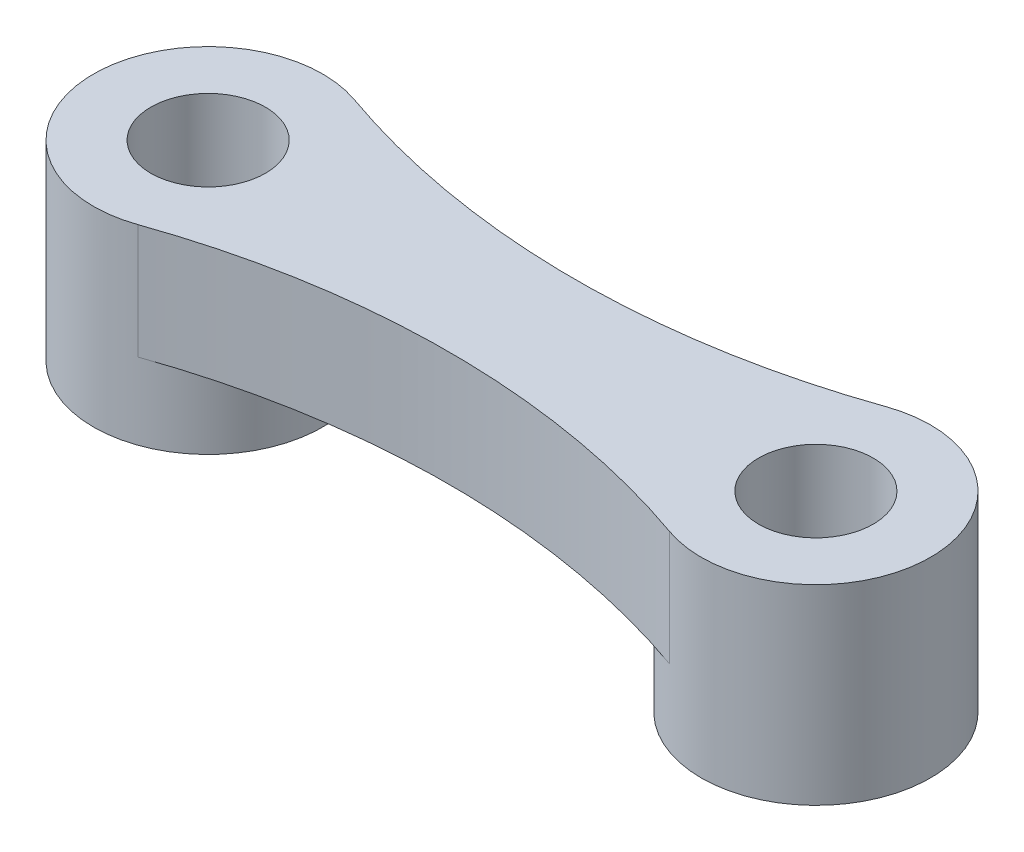
ISO-10303-21;
HEADER;
FILE_DESCRIPTION(('STEP AP214'),'2;1');
FILE_NAME('part.step','',(''),(''),'','','');
FILE_SCHEMA(('AUTOMOTIVE_DESIGN { 1 0 10303 214 1 1 1 1 }'));
ENDSEC;
DATA;
#1=APPLICATION_CONTEXT('core data for automotive mechanical design processes');
#2=APPLICATION_PROTOCOL_DEFINITION('international standard','automotive_design',2000,#1);
#3=PRODUCT_CONTEXT('',#1,'mechanical');
#4=PRODUCT('Part','Part','',(#3));
#5=PRODUCT_RELATED_PRODUCT_CATEGORY('part','',(#4));
#6=PRODUCT_DEFINITION_FORMATION('','',#4);
#7=PRODUCT_DEFINITION_CONTEXT('part definition',#1,'design');
#8=PRODUCT_DEFINITION('design','',#6,#7);
#9=PRODUCT_DEFINITION_SHAPE('','',#8);
#10=(LENGTH_UNIT() NAMED_UNIT(*) SI_UNIT(.MILLI.,.METRE.));
#11=(NAMED_UNIT(*) PLANE_ANGLE_UNIT() SI_UNIT($,.RADIAN.));
#12=(NAMED_UNIT(*) SI_UNIT($,.STERADIAN.) SOLID_ANGLE_UNIT());
#13=UNCERTAINTY_MEASURE_WITH_UNIT(LENGTH_MEASURE(1.E-05),#10,'distance_accuracy_value','');
#14=(GEOMETRIC_REPRESENTATION_CONTEXT(3) GLOBAL_UNCERTAINTY_ASSIGNED_CONTEXT((#13)) GLOBAL_UNIT_ASSIGNED_CONTEXT((#10,
#11,#12)) REPRESENTATION_CONTEXT('',''));
#15=CARTESIAN_POINT('',(0.,0.,0.));
#16=DIRECTION('',(0.,0.,1.));
#17=DIRECTION('',(1.,0.,0.));
#18=AXIS2_PLACEMENT_3D('',#15,#16,#17);
#19=CARTESIAN_POINT('',(-7.95,3.,0.));
#20=DIRECTION('',(0.,1.,0.));
#21=DIRECTION('',(0.,0.,1.));
#22=AXIS2_PLACEMENT_3D('',#19,#20,#21);
#23=PLANE('',#22);
#24=CARTESIAN_POINT('',(-7.95,3.,0.));
#25=DIRECTION('',(0.,1.,0.));
#26=DIRECTION('',(0.,0.,1.));
#27=AXIS2_PLACEMENT_3D('',#24,#25,#26);
#28=CIRCLE('',#27,1.5);
#29=CARTESIAN_POINT('',(-7.95,3.,1.5));
#30=VERTEX_POINT('',#29);
#31=EDGE_CURVE('E153',#30,#30,#28,.T.);
#32=ORIENTED_EDGE('',*,*,#31,.F.);
#33=EDGE_LOOP('',(#32));
#34=FACE_BOUND('',#33,.T.);
#35=CARTESIAN_POINT('',(7.95,3.,0.));
#36=DIRECTION('',(0.,1.,0.));
#37=DIRECTION('',(0.,0.,1.));
#38=AXIS2_PLACEMENT_3D('',#35,#36,#37);
#39=CIRCLE('',#38,1.5);
#40=CARTESIAN_POINT('',(7.95,3.,1.5));
#41=VERTEX_POINT('',#40);
#42=EDGE_CURVE('E148',#41,#41,#39,.T.);
#43=ORIENTED_EDGE('',*,*,#42,.F.);
#44=EDGE_LOOP('',(#43));
#45=FACE_BOUND('',#44,.T.);
#46=CARTESIAN_POINT('',(7.95,3.,0.));
#47=DIRECTION('',(0.,1.,0.));
#48=DIRECTION('',(0.,0.,1.));
#49=AXIS2_PLACEMENT_3D('',#46,#47,#48);
#50=CIRCLE('',#49,3.);
#51=CARTESIAN_POINT('',(6.95625,3.,2.83062907098404));
#52=VERTEX_POINT('',#51);
#53=CARTESIAN_POINT('',(6.95625000000001,3.,-2.83062907098404));
#54=VERTEX_POINT('',#53);
#55=EDGE_CURVE('E13',#52,#54,#50,.T.);
#56=ORIENTED_EDGE('',*,*,#55,.T.);
#57=CARTESIAN_POINT('',(0.,3.,-22.6450325678724));
#58=DIRECTION('',(0.,-1.,0.));
#59=DIRECTION('',(0.,0.,1.));
#60=AXIS2_PLACEMENT_3D('',#57,#58,#59);
#61=CIRCLE('',#60,21.);
#62=CARTESIAN_POINT('',(-6.95625,3.,-2.83062907098405));
#63=VERTEX_POINT('',#62);
#64=EDGE_CURVE('E143',#54,#63,#61,.T.);
#65=ORIENTED_EDGE('',*,*,#64,.T.);
#66=CARTESIAN_POINT('',(-7.95,3.,0.));
#67=DIRECTION('',(0.,1.,0.));
#68=DIRECTION('',(0.,0.,1.));
#69=AXIS2_PLACEMENT_3D('',#66,#67,#68);
#70=CIRCLE('',#69,3.);
#71=CARTESIAN_POINT('',(-6.95625,3.,2.83062907098405));
#72=VERTEX_POINT('',#71);
#73=EDGE_CURVE('E82',#63,#72,#70,.T.);
#74=ORIENTED_EDGE('',*,*,#73,.T.);
#75=CARTESIAN_POINT('',(0.,3.,22.6450325678724));
#76=DIRECTION('',(0.,-1.,0.));
#77=DIRECTION('',(0.,0.,-1.));
#78=AXIS2_PLACEMENT_3D('',#75,#76,#77);
#79=CIRCLE('',#78,21.);
#80=EDGE_CURVE('E139',#72,#52,#79,.T.);
#81=ORIENTED_EDGE('',*,*,#80,.T.);
#82=EDGE_LOOP('',(#56,#65,#74,#81));
#83=FACE_BOUND('',#82,.T.);
#84=ADVANCED_FACE('F74',(#34,#45,#83),#23,.T.);
#85=CARTESIAN_POINT('',(-7.95,0.,0.));
#86=DIRECTION('',(0.,1.,0.));
#87=DIRECTION('',(0.,0.,1.));
#88=AXIS2_PLACEMENT_3D('',#85,#86,#87);
#89=PLANE('',#88);
#90=CARTESIAN_POINT('',(0.,0.,-22.6450325678724));
#91=DIRECTION('',(0.,-1.,0.));
#92=DIRECTION('',(0.,0.,1.));
#93=AXIS2_PLACEMENT_3D('',#90,#91,#92);
#94=CIRCLE('',#93,21.);
#95=CARTESIAN_POINT('',(6.95625000000001,0.,-2.83062907098404));
#96=VERTEX_POINT('',#95);
#97=CARTESIAN_POINT('',(-6.95625,0.,-2.83062907098405));
#98=VERTEX_POINT('',#97);
#99=EDGE_CURVE('E118',#96,#98,#94,.T.);
#100=ORIENTED_EDGE('',*,*,#99,.F.);
#101=CARTESIAN_POINT('',(7.95,0.,0.));
#102=DIRECTION('',(0.,1.,0.));
#103=DIRECTION('',(0.,0.,1.));
#104=AXIS2_PLACEMENT_3D('',#101,#102,#103);
#105=CIRCLE('',#104,3.);
#106=CARTESIAN_POINT('',(6.95625,0.,2.83062907098405));
#107=VERTEX_POINT('',#106);
#108=EDGE_CURVE('E112',#96,#107,#105,.T.);
#109=ORIENTED_EDGE('',*,*,#108,.T.);
#110=CARTESIAN_POINT('',(0.,0.,22.6450325678724));
#111=DIRECTION('',(0.,-1.,0.));
#112=DIRECTION('',(0.,0.,-1.));
#113=AXIS2_PLACEMENT_3D('',#110,#111,#112);
#114=CIRCLE('',#113,21.);
#115=CARTESIAN_POINT('',(-6.95625,0.,2.83062907098405));
#116=VERTEX_POINT('',#115);
#117=EDGE_CURVE('E116',#116,#107,#114,.T.);
#118=ORIENTED_EDGE('',*,*,#117,.F.);
#119=CARTESIAN_POINT('',(-7.95,0.,0.));
#120=DIRECTION('',(0.,1.,0.));
#121=DIRECTION('',(0.,0.,1.));
#122=AXIS2_PLACEMENT_3D('',#119,#120,#121);
#123=CIRCLE('',#122,3.);
#124=EDGE_CURVE('E89',#116,#98,#123,.T.);
#125=ORIENTED_EDGE('',*,*,#124,.T.);
#126=EDGE_LOOP('',(#100,#109,#118,#125));
#127=FACE_BOUND('',#126,.T.);
#128=ADVANCED_FACE('F114',(#127),#89,.F.);
#129=CARTESIAN_POINT('',(-7.95,3.,0.));
#130=DIRECTION('',(0.,-1.,0.));
#131=DIRECTION('',(0.,0.,-1.));
#132=AXIS2_PLACEMENT_3D('',#129,#130,#131);
#133=CYLINDRICAL_SURFACE('',#132,3.);
#134=DIRECTION('',(0.,1.,0.));
#135=VECTOR('',#134,1.);
#136=CARTESIAN_POINT('',(-6.95625,0.,-2.83062907098405));
#137=LINE('',#136,#135);
#138=EDGE_CURVE('E136',#98,#63,#137,.T.);
#139=ORIENTED_EDGE('',*,*,#138,.F.);
#140=ORIENTED_EDGE('',*,*,#124,.F.);
#141=DIRECTION('',(0.,1.,0.));
#142=VECTOR('',#141,1.);
#143=CARTESIAN_POINT('',(-6.95625,0.,2.83062907098405));
#144=LINE('',#143,#142);
#145=EDGE_CURVE('E133',#116,#72,#144,.T.);
#146=ORIENTED_EDGE('',*,*,#145,.T.);
#147=ORIENTED_EDGE('',*,*,#73,.F.);
#148=EDGE_LOOP('',(#139,#140,#146,#147));
#149=FACE_BOUND('',#148,.T.);
#150=CARTESIAN_POINT('',(-7.95,-2.,0.));
#151=DIRECTION('',(0.,1.,0.));
#152=DIRECTION('',(0.,0.,1.));
#153=AXIS2_PLACEMENT_3D('',#150,#151,#152);
#154=CIRCLE('',#153,3.);
#155=CARTESIAN_POINT('',(-7.95,-2.,3.));
#156=VERTEX_POINT('',#155);
#157=EDGE_CURVE('E146',#156,#156,#154,.T.);
#158=ORIENTED_EDGE('',*,*,#157,.T.);
#159=EDGE_LOOP('',(#158));
#160=FACE_BOUND('',#159,.T.);
#161=ADVANCED_FACE('F76',(#149,#160),#133,.T.);
#162=CARTESIAN_POINT('',(7.95,3.,0.));
#163=DIRECTION('',(0.,-1.,0.));
#164=DIRECTION('',(0.,0.,-1.));
#165=AXIS2_PLACEMENT_3D('',#162,#163,#164);
#166=CYLINDRICAL_SURFACE('',#165,3.);
#167=DIRECTION('',(0.,1.,0.));
#168=VECTOR('',#167,1.);
#169=CARTESIAN_POINT('',(6.95625,0.,2.83062907098404));
#170=LINE('',#169,#168);
#171=EDGE_CURVE('E126',#107,#52,#170,.T.);
#172=ORIENTED_EDGE('',*,*,#171,.F.);
#173=ORIENTED_EDGE('',*,*,#108,.F.);
#174=DIRECTION('',(0.,1.,0.));
#175=VECTOR('',#174,1.);
#176=CARTESIAN_POINT('',(6.95625000000001,0.,-2.83062907098404));
#177=LINE('',#176,#175);
#178=EDGE_CURVE('E132',#96,#54,#177,.T.);
#179=ORIENTED_EDGE('',*,*,#178,.T.);
#180=ORIENTED_EDGE('',*,*,#55,.F.);
#181=EDGE_LOOP('',(#172,#173,#179,#180));
#182=FACE_BOUND('',#181,.T.);
#183=CARTESIAN_POINT('',(7.95,-2.,0.));
#184=DIRECTION('',(0.,1.,0.));
#185=DIRECTION('',(0.,0.,1.));
#186=AXIS2_PLACEMENT_3D('',#183,#184,#185);
#187=CIRCLE('',#186,3.);
#188=CARTESIAN_POINT('',(7.95,-2.,3.));
#189=VERTEX_POINT('',#188);
#190=EDGE_CURVE('E122',#189,#189,#187,.T.);
#191=ORIENTED_EDGE('',*,*,#190,.T.);
#192=EDGE_LOOP('',(#191));
#193=FACE_BOUND('',#192,.T.);
#194=ADVANCED_FACE('F127',(#182,#193),#166,.T.);
#195=CARTESIAN_POINT('',(-7.95,3.,0.));
#196=DIRECTION('',(0.,-1.,0.));
#197=DIRECTION('',(0.,0.,-1.));
#198=AXIS2_PLACEMENT_3D('',#195,#196,#197);
#199=CYLINDRICAL_SURFACE('',#198,1.5);
#200=ORIENTED_EDGE('',*,*,#31,.T.);
#201=EDGE_LOOP('',(#200));
#202=FACE_BOUND('',#201,.T.);
#203=CARTESIAN_POINT('',(-7.95,-2.,0.));
#204=DIRECTION('',(0.,1.,0.));
#205=DIRECTION('',(0.,0.,1.));
#206=AXIS2_PLACEMENT_3D('',#203,#204,#205);
#207=CIRCLE('',#206,1.5);
#208=CARTESIAN_POINT('',(-7.95,-2.,1.5));
#209=VERTEX_POINT('',#208);
#210=EDGE_CURVE('E163',#209,#209,#207,.T.);
#211=ORIENTED_EDGE('',*,*,#210,.F.);
#212=EDGE_LOOP('',(#211));
#213=FACE_BOUND('',#212,.T.);
#214=ADVANCED_FACE('F178',(#202,#213),#199,.F.);
#215=CARTESIAN_POINT('',(7.95,3.,0.));
#216=DIRECTION('',(0.,-1.,0.));
#217=DIRECTION('',(0.,0.,-1.));
#218=AXIS2_PLACEMENT_3D('',#215,#216,#217);
#219=CYLINDRICAL_SURFACE('',#218,1.5);
#220=ORIENTED_EDGE('',*,*,#42,.T.);
#221=EDGE_LOOP('',(#220));
#222=FACE_BOUND('',#221,.T.);
#223=CARTESIAN_POINT('',(7.95,-2.,0.));
#224=DIRECTION('',(0.,1.,0.));
#225=DIRECTION('',(0.,0.,1.));
#226=AXIS2_PLACEMENT_3D('',#223,#224,#225);
#227=CIRCLE('',#226,1.5);
#228=CARTESIAN_POINT('',(7.95,-2.,1.5));
#229=VERTEX_POINT('',#228);
#230=EDGE_CURVE('E123',#229,#229,#227,.T.);
#231=ORIENTED_EDGE('',*,*,#230,.F.);
#232=EDGE_LOOP('',(#231));
#233=FACE_BOUND('',#232,.T.);
#234=ADVANCED_FACE('F175',(#222,#233),#219,.F.);
#235=CARTESIAN_POINT('',(0.,0.,-22.6450325678724));
#236=DIRECTION('',(0.,1.,0.));
#237=DIRECTION('',(0.,0.,1.));
#238=AXIS2_PLACEMENT_3D('',#235,#236,#237);
#239=CYLINDRICAL_SURFACE('',#238,21.);
#240=ORIENTED_EDGE('',*,*,#64,.F.);
#241=ORIENTED_EDGE('',*,*,#178,.F.);
#242=ORIENTED_EDGE('',*,*,#99,.T.);
#243=ORIENTED_EDGE('',*,*,#138,.T.);
#244=EDGE_LOOP('',(#240,#241,#242,#243));
#245=FACE_BOUND('',#244,.T.);
#246=ADVANCED_FACE('F177',(#245),#239,.F.);
#247=CARTESIAN_POINT('',(0.,0.,22.6450325678724));
#248=DIRECTION('',(0.,1.,0.));
#249=DIRECTION('',(0.,0.,1.));
#250=AXIS2_PLACEMENT_3D('',#247,#248,#249);
#251=CYLINDRICAL_SURFACE('',#250,21.);
#252=ORIENTED_EDGE('',*,*,#80,.F.);
#253=ORIENTED_EDGE('',*,*,#145,.F.);
#254=ORIENTED_EDGE('',*,*,#117,.T.);
#255=ORIENTED_EDGE('',*,*,#171,.T.);
#256=EDGE_LOOP('',(#252,#253,#254,#255));
#257=FACE_BOUND('',#256,.T.);
#258=ADVANCED_FACE('F135',(#257),#251,.F.);
#259=CARTESIAN_POINT('',(-7.95,-2.,0.));
#260=DIRECTION('',(0.,1.,0.));
#261=DIRECTION('',(0.,0.,1.));
#262=AXIS2_PLACEMENT_3D('',#259,#260,#261);
#263=PLANE('',#262);
#264=ORIENTED_EDGE('',*,*,#210,.T.);
#265=EDGE_LOOP('',(#264));
#266=FACE_BOUND('',#265,.T.);
#267=ORIENTED_EDGE('',*,*,#157,.F.);
#268=EDGE_LOOP('',(#267));
#269=FACE_BOUND('',#268,.T.);
#270=ADVANCED_FACE('F230',(#266,#269),#263,.F.);
#271=CARTESIAN_POINT('',(7.95,-2.,0.));
#272=DIRECTION('',(0.,1.,0.));
#273=DIRECTION('',(0.,0.,1.));
#274=AXIS2_PLACEMENT_3D('',#271,#272,#273);
#275=PLANE('',#274);
#276=ORIENTED_EDGE('',*,*,#230,.T.);
#277=EDGE_LOOP('',(#276));
#278=FACE_BOUND('',#277,.T.);
#279=ORIENTED_EDGE('',*,*,#190,.F.);
#280=EDGE_LOOP('',(#279));
#281=FACE_BOUND('',#280,.T.);
#282=ADVANCED_FACE('F172',(#278,#281),#275,.F.);
#283=CLOSED_SHELL('',(#84,#128,#161,#194,#214,#234,#246,#258,#270,#282));
#284=MANIFOLD_SOLID_BREP('B2',#283);
#285=ADVANCED_BREP_SHAPE_REPRESENTATION('',(#18,#284),#14);
#286=SHAPE_DEFINITION_REPRESENTATION(#9,#285);
ENDSEC;
END-ISO-10303-21;
